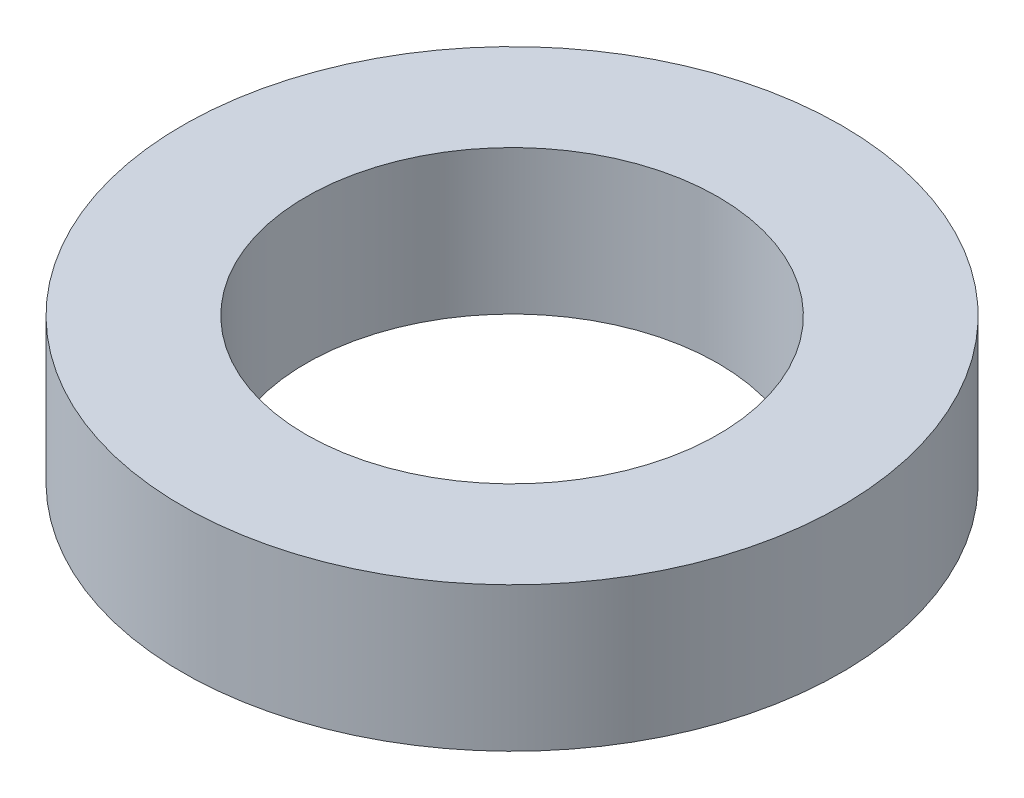
ISO-10303-21;
HEADER;
FILE_DESCRIPTION(('STEP AP214'),'2;1');
FILE_NAME('part.step','',(''),(''),'','','');
FILE_SCHEMA(('AUTOMOTIVE_DESIGN { 1 0 10303 214 1 1 1 1 }'));
ENDSEC;
DATA;
#1=APPLICATION_CONTEXT('core data for automotive mechanical design processes');
#2=APPLICATION_PROTOCOL_DEFINITION('international standard','automotive_design',2000,#1);
#3=PRODUCT_CONTEXT('',#1,'mechanical');
#4=PRODUCT('Part','Part','',(#3));
#5=PRODUCT_RELATED_PRODUCT_CATEGORY('part','',(#4));
#6=PRODUCT_DEFINITION_FORMATION('','',#4);
#7=PRODUCT_DEFINITION_CONTEXT('part definition',#1,'design');
#8=PRODUCT_DEFINITION('design','',#6,#7);
#9=PRODUCT_DEFINITION_SHAPE('','',#8);
#10=(LENGTH_UNIT() NAMED_UNIT(*) SI_UNIT(.MILLI.,.METRE.));
#11=(NAMED_UNIT(*) PLANE_ANGLE_UNIT() SI_UNIT($,.RADIAN.));
#12=(NAMED_UNIT(*) SI_UNIT($,.STERADIAN.) SOLID_ANGLE_UNIT());
#13=UNCERTAINTY_MEASURE_WITH_UNIT(LENGTH_MEASURE(1.E-05),#10,'distance_accuracy_value','');
#14=(GEOMETRIC_REPRESENTATION_CONTEXT(3) GLOBAL_UNCERTAINTY_ASSIGNED_CONTEXT((#13)) GLOBAL_UNIT_ASSIGNED_CONTEXT((#10,
#11,#12)) REPRESENTATION_CONTEXT('',''));
#15=CARTESIAN_POINT('',(0.,0.,0.));
#16=DIRECTION('',(0.,0.,1.));
#17=DIRECTION('',(1.,0.,0.));
#18=AXIS2_PLACEMENT_3D('',#15,#16,#17);
#19=CARTESIAN_POINT('',(0.,-33.,0.));
#20=DIRECTION('',(0.,-1.,0.));
#21=DIRECTION('',(0.,0.,-1.));
#22=AXIS2_PLACEMENT_3D('',#19,#20,#21);
#23=CYLINDRICAL_SURFACE('',#22,10.);
#24=CARTESIAN_POINT('',(0.,-33.,0.));
#25=DIRECTION('',(0.,-1.,0.));
#26=DIRECTION('',(0.,0.,-1.));
#27=AXIS2_PLACEMENT_3D('',#24,#25,#26);
#28=CIRCLE('',#27,10.);
#29=CARTESIAN_POINT('',(0.,-33.,-10.));
#30=VERTEX_POINT('',#29);
#31=EDGE_CURVE('E23',#30,#30,#28,.T.);
#32=ORIENTED_EDGE('',*,*,#31,.F.);
#33=EDGE_LOOP('',(#32));
#34=FACE_BOUND('',#33,.T.);
#35=CARTESIAN_POINT('',(0.,-40.,0.));
#36=DIRECTION('',(0.,-1.,0.));
#37=DIRECTION('',(0.,0.,-1.));
#38=AXIS2_PLACEMENT_3D('',#35,#36,#37);
#39=CIRCLE('',#38,10.);
#40=CARTESIAN_POINT('',(0.,-40.,-10.));
#41=VERTEX_POINT('',#40);
#42=EDGE_CURVE('E34',#41,#41,#39,.T.);
#43=ORIENTED_EDGE('',*,*,#42,.T.);
#44=EDGE_LOOP('',(#43));
#45=FACE_BOUND('',#44,.T.);
#46=ADVANCED_FACE('F15',(#34,#45),#23,.F.);
#47=CARTESIAN_POINT('',(0.,-33.,0.));
#48=DIRECTION('',(0.,-1.,0.));
#49=DIRECTION('',(0.,0.,-1.));
#50=AXIS2_PLACEMENT_3D('',#47,#48,#49);
#51=CYLINDRICAL_SURFACE('',#50,16.);
#52=CARTESIAN_POINT('',(0.,-33.,0.));
#53=DIRECTION('',(0.,-1.,0.));
#54=DIRECTION('',(0.,0.,-1.));
#55=AXIS2_PLACEMENT_3D('',#52,#53,#54);
#56=CIRCLE('',#55,16.);
#57=CARTESIAN_POINT('',(0.,-33.,-16.));
#58=VERTEX_POINT('',#57);
#59=EDGE_CURVE('E10',#58,#58,#56,.T.);
#60=ORIENTED_EDGE('',*,*,#59,.T.);
#61=EDGE_LOOP('',(#60));
#62=FACE_BOUND('',#61,.T.);
#63=CARTESIAN_POINT('',(0.,-40.,0.));
#64=DIRECTION('',(0.,-1.,0.));
#65=DIRECTION('',(0.,0.,-1.));
#66=AXIS2_PLACEMENT_3D('',#63,#64,#65);
#67=CIRCLE('',#66,16.);
#68=CARTESIAN_POINT('',(0.,-40.,-16.));
#69=VERTEX_POINT('',#68);
#70=EDGE_CURVE('E18',#69,#69,#67,.T.);
#71=ORIENTED_EDGE('',*,*,#70,.F.);
#72=EDGE_LOOP('',(#71));
#73=FACE_BOUND('',#72,.T.);
#74=ADVANCED_FACE('F46',(#62,#73),#51,.T.);
#75=CARTESIAN_POINT('',(0.,-33.,0.));
#76=DIRECTION('',(0.,-1.,0.));
#77=DIRECTION('',(1.,0.,0.));
#78=AXIS2_PLACEMENT_3D('',#75,#76,#77);
#79=PLANE('',#78);
#80=ORIENTED_EDGE('',*,*,#31,.T.);
#81=EDGE_LOOP('',(#80));
#82=FACE_BOUND('',#81,.T.);
#83=ORIENTED_EDGE('',*,*,#59,.F.);
#84=EDGE_LOOP('',(#83));
#85=FACE_BOUND('',#84,.T.);
#86=ADVANCED_FACE('F48',(#82,#85),#79,.F.);
#87=CARTESIAN_POINT('',(0.,-40.,0.));
#88=DIRECTION('',(0.,-1.,0.));
#89=DIRECTION('',(1.,0.,0.));
#90=AXIS2_PLACEMENT_3D('',#87,#88,#89);
#91=PLANE('',#90);
#92=ORIENTED_EDGE('',*,*,#42,.F.);
#93=EDGE_LOOP('',(#92));
#94=FACE_BOUND('',#93,.T.);
#95=ORIENTED_EDGE('',*,*,#70,.T.);
#96=EDGE_LOOP('',(#95));
#97=FACE_BOUND('',#96,.T.);
#98=ADVANCED_FACE('F44',(#94,#97),#91,.T.);
#99=CLOSED_SHELL('',(#46,#74,#86,#98));
#100=MANIFOLD_SOLID_BREP('B1',#99);
#101=ADVANCED_BREP_SHAPE_REPRESENTATION('',(#18,#100),#14);
#102=SHAPE_DEFINITION_REPRESENTATION(#9,#101);
ENDSEC;
END-ISO-10303-21;
